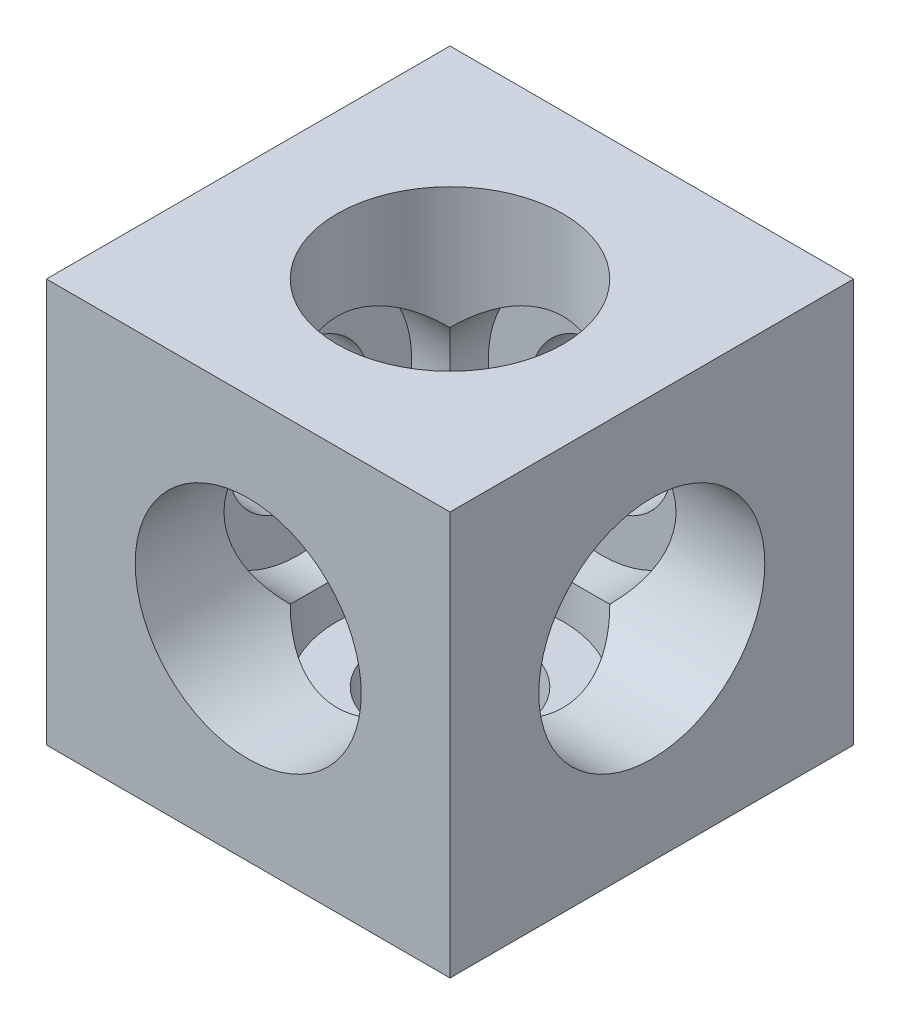
ISO-10303-21;
HEADER;
FILE_DESCRIPTION(('STEP AP214'),'2;1');
FILE_NAME('part.step','',(''),(''),'','','');
FILE_SCHEMA(('AUTOMOTIVE_DESIGN { 1 0 10303 214 1 1 1 1 }'));
ENDSEC;
DATA;
#1=APPLICATION_CONTEXT('core data for automotive mechanical design processes');
#2=APPLICATION_PROTOCOL_DEFINITION('international standard','automotive_design',2000,#1);
#3=PRODUCT_CONTEXT('',#1,'mechanical');
#4=PRODUCT('Part','Part','',(#3));
#5=PRODUCT_RELATED_PRODUCT_CATEGORY('part','',(#4));
#6=PRODUCT_DEFINITION_FORMATION('','',#4);
#7=PRODUCT_DEFINITION_CONTEXT('part definition',#1,'design');
#8=PRODUCT_DEFINITION('design','',#6,#7);
#9=PRODUCT_DEFINITION_SHAPE('','',#8);
#10=(LENGTH_UNIT() NAMED_UNIT(*) SI_UNIT(.MILLI.,.METRE.));
#11=(NAMED_UNIT(*) PLANE_ANGLE_UNIT() SI_UNIT($,.RADIAN.));
#12=(NAMED_UNIT(*) SI_UNIT($,.STERADIAN.) SOLID_ANGLE_UNIT());
#13=UNCERTAINTY_MEASURE_WITH_UNIT(LENGTH_MEASURE(1.E-05),#10,'distance_accuracy_value','');
#14=(GEOMETRIC_REPRESENTATION_CONTEXT(3) GLOBAL_UNCERTAINTY_ASSIGNED_CONTEXT((#13)) GLOBAL_UNIT_ASSIGNED_CONTEXT((#10,
#11,#12)) REPRESENTATION_CONTEXT('',''));
#15=CARTESIAN_POINT('',(0.,0.,0.));
#16=DIRECTION('',(0.,0.,1.));
#17=DIRECTION('',(1.,0.,0.));
#18=AXIS2_PLACEMENT_3D('',#15,#16,#17);
#19=CARTESIAN_POINT('',(-10.,0.,0.));
#20=DIRECTION('',(1.,0.,0.));
#21=DIRECTION('',(0.,0.,-1.));
#22=AXIS2_PLACEMENT_3D('',#19,#20,#21);
#23=CYLINDRICAL_SURFACE('',#22,3.5);
#24=CARTESIAN_POINT('',(-10.,0.,0.));
#25=DIRECTION('',(1.,0.,0.));
#26=DIRECTION('',(0.,0.,-1.));
#27=AXIS2_PLACEMENT_3D('',#24,#25,#26);
#28=CIRCLE('',#27,3.5);
#29=CARTESIAN_POINT('',(-10.,0.,-3.5));
#30=VERTEX_POINT('',#29);
#31=EDGE_CURVE('E147',#30,#30,#28,.T.);
#32=ORIENTED_EDGE('',*,*,#31,.F.);
#33=EDGE_LOOP('',(#32));
#34=FACE_BOUND('',#33,.T.);
#35=CARTESIAN_POINT('',(-7.5,0.,0.));
#36=DIRECTION('',(1.,0.,0.));
#37=DIRECTION('',(0.,0.,-1.));
#38=AXIS2_PLACEMENT_3D('',#35,#36,#37);
#39=CIRCLE('',#38,3.5);
#40=CARTESIAN_POINT('',(-7.5,0.,-3.5));
#41=VERTEX_POINT('',#40);
#42=EDGE_CURVE('E40',#41,#41,#39,.F.);
#43=ORIENTED_EDGE('',*,*,#42,.F.);
#44=EDGE_LOOP('',(#43));
#45=FACE_BOUND('',#44,.T.);
#46=ADVANCED_FACE('F36',(#34,#45),#23,.F.);
#47=CARTESIAN_POINT('',(0.,0.,-10.));
#48=DIRECTION('',(0.,0.,1.));
#49=DIRECTION('',(1.,0.,0.));
#50=AXIS2_PLACEMENT_3D('',#47,#48,#49);
#51=CYLINDRICAL_SURFACE('',#50,3.5);
#52=CARTESIAN_POINT('',(0.,0.,-10.));
#53=DIRECTION('',(0.,0.,1.));
#54=DIRECTION('',(1.,0.,0.));
#55=AXIS2_PLACEMENT_3D('',#52,#53,#54);
#56=CIRCLE('',#55,3.5);
#57=CARTESIAN_POINT('',(3.5,0.,-10.));
#58=VERTEX_POINT('',#57);
#59=EDGE_CURVE('E150',#58,#58,#56,.T.);
#60=ORIENTED_EDGE('',*,*,#59,.F.);
#61=EDGE_LOOP('',(#60));
#62=FACE_BOUND('',#61,.T.);
#63=CARTESIAN_POINT('',(0.,0.,-7.5));
#64=DIRECTION('',(0.,0.,1.));
#65=DIRECTION('',(1.,0.,0.));
#66=AXIS2_PLACEMENT_3D('',#63,#64,#65);
#67=CIRCLE('',#66,3.5);
#68=CARTESIAN_POINT('',(3.5,0.,-7.5));
#69=VERTEX_POINT('',#68);
#70=EDGE_CURVE('E124',#69,#69,#67,.F.);
#71=ORIENTED_EDGE('',*,*,#70,.F.);
#72=EDGE_LOOP('',(#71));
#73=FACE_BOUND('',#72,.T.);
#74=ADVANCED_FACE('F225',(#62,#73),#51,.F.);
#75=CARTESIAN_POINT('',(0.,-7.5,0.));
#76=DIRECTION('',(0.,1.,0.));
#77=DIRECTION('',(-1.,0.,0.));
#78=AXIS2_PLACEMENT_3D('',#75,#76,#77);
#79=CYLINDRICAL_SURFACE('',#78,5.6);
#80=CARTESIAN_POINT('',(0.,10.,0.));
#81=DIRECTION('',(0.,1.,0.));
#82=DIRECTION('',(-1.,0.,0.));
#83=AXIS2_PLACEMENT_3D('',#80,#81,#82);
#84=CIRCLE('',#83,5.6);
#85=CARTESIAN_POINT('',(-5.6,10.,0.));
#86=VERTEX_POINT('',#85);
#87=EDGE_CURVE('E126',#86,#86,#84,.T.);
#88=ORIENTED_EDGE('',*,*,#87,.T.);
#89=EDGE_LOOP('',(#88));
#90=FACE_BOUND('',#89,.T.);
#91=CARTESIAN_POINT('',(0.,0.,0.));
#92=DIRECTION('',(0.,0.707106781186547,-0.707106781186547));
#93=DIRECTION('',(0.,0.707106781186547,0.707106781186547));
#94=AXIS2_PLACEMENT_3D('',#91,#92,#93);
#95=ELLIPSE('',#94,7.91959594928933,5.6);
#96=CARTESIAN_POINT('',(3.95979797464466,3.95979797464467,3.95979797464467));
#97=VERTEX_POINT('',#96);
#98=CARTESIAN_POINT('',(-3.95979797464467,3.95979797464467,3.95979797464467));
#99=VERTEX_POINT('',#98);
#100=EDGE_CURVE('E113',#97,#99,#95,.F.);
#101=ORIENTED_EDGE('',*,*,#100,.T.);
#102=CARTESIAN_POINT('',(0.,0.,0.));
#103=DIRECTION('',(0.707106781186547,0.707106781186548,0.));
#104=DIRECTION('',(-0.707106781186547,0.707106781186547,0.));
#105=AXIS2_PLACEMENT_3D('',#102,#103,#104);
#106=ELLIPSE('',#105,7.91959594928933,5.6);
#107=CARTESIAN_POINT('',(-3.95979797464466,3.95979797464466,-3.95979797464467));
#108=VERTEX_POINT('',#107);
#109=EDGE_CURVE('E100',#99,#108,#106,.F.);
#110=ORIENTED_EDGE('',*,*,#109,.T.);
#111=CARTESIAN_POINT('',(0.,0.,0.));
#112=DIRECTION('',(0.,0.707106781186547,0.707106781186547));
#113=DIRECTION('',(0.,0.707106781186547,-0.707106781186547));
#114=AXIS2_PLACEMENT_3D('',#111,#112,#113);
#115=ELLIPSE('',#114,7.91959594928933,5.6);
#116=CARTESIAN_POINT('',(3.95979797464466,3.95979797464466,-3.95979797464467));
#117=VERTEX_POINT('',#116);
#118=EDGE_CURVE('E106',#108,#117,#115,.F.);
#119=ORIENTED_EDGE('',*,*,#118,.T.);
#120=CARTESIAN_POINT('',(0.,0.,0.));
#121=DIRECTION('',(-0.707106781186547,0.707106781186547,0.));
#122=DIRECTION('',(0.707106781186547,0.707106781186548,0.));
#123=AXIS2_PLACEMENT_3D('',#120,#121,#122);
#124=ELLIPSE('',#123,7.91959594928933,5.6);
#125=EDGE_CURVE('E52',#117,#97,#124,.F.);
#126=ORIENTED_EDGE('',*,*,#125,.T.);
#127=EDGE_LOOP('',(#101,#110,#119,#126));
#128=FACE_BOUND('',#127,.T.);
#129=ADVANCED_FACE('F111',(#90,#128),#79,.F.);
#130=CARTESIAN_POINT('',(0.,-10.,0.));
#131=DIRECTION('',(0.,1.,0.));
#132=DIRECTION('',(-1.,0.,0.));
#133=AXIS2_PLACEMENT_3D('',#130,#131,#132);
#134=CYLINDRICAL_SURFACE('',#133,3.5);
#135=CARTESIAN_POINT('',(0.,-10.,0.));
#136=DIRECTION('',(0.,1.,0.));
#137=DIRECTION('',(-1.,0.,0.));
#138=AXIS2_PLACEMENT_3D('',#135,#136,#137);
#139=CIRCLE('',#138,3.5);
#140=CARTESIAN_POINT('',(-3.5,-10.,0.));
#141=VERTEX_POINT('',#140);
#142=EDGE_CURVE('E153',#141,#141,#139,.T.);
#143=ORIENTED_EDGE('',*,*,#142,.F.);
#144=EDGE_LOOP('',(#143));
#145=FACE_BOUND('',#144,.T.);
#146=CARTESIAN_POINT('',(0.,-7.5,0.));
#147=DIRECTION('',(0.,1.,0.));
#148=DIRECTION('',(-1.,0.,0.));
#149=AXIS2_PLACEMENT_3D('',#146,#147,#148);
#150=CIRCLE('',#149,3.5);
#151=CARTESIAN_POINT('',(-3.5,-7.5,0.));
#152=VERTEX_POINT('',#151);
#153=EDGE_CURVE('E145',#152,#152,#150,.F.);
#154=ORIENTED_EDGE('',*,*,#153,.F.);
#155=EDGE_LOOP('',(#154));
#156=FACE_BOUND('',#155,.T.);
#157=ADVANCED_FACE('F238',(#145,#156),#134,.F.);
#158=CARTESIAN_POINT('',(-10.,-10.,10.));
#159=DIRECTION('',(1.,0.,0.));
#160=DIRECTION('',(0.,0.,-1.));
#161=AXIS2_PLACEMENT_3D('',#158,#159,#160);
#162=PLANE('',#161);
#163=ORIENTED_EDGE('',*,*,#31,.T.);
#164=EDGE_LOOP('',(#163));
#165=FACE_BOUND('',#164,.T.);
#166=DIRECTION('',(0.,-1.,0.));
#167=VECTOR('',#166,1.);
#168=CARTESIAN_POINT('',(-10.,-10.,-10.));
#169=LINE('',#168,#167);
#170=CARTESIAN_POINT('',(-10.,10.,-10.));
#171=VERTEX_POINT('',#170);
#172=CARTESIAN_POINT('',(-10.,-10.,-10.));
#173=VERTEX_POINT('',#172);
#174=EDGE_CURVE('E156',#171,#173,#169,.T.);
#175=ORIENTED_EDGE('',*,*,#174,.T.);
#176=DIRECTION('',(0.,0.,-1.));
#177=VECTOR('',#176,1.);
#178=CARTESIAN_POINT('',(-10.,-10.,10.));
#179=LINE('',#178,#177);
#180=CARTESIAN_POINT('',(-10.,-10.,10.));
#181=VERTEX_POINT('',#180);
#182=EDGE_CURVE('E183',#181,#173,#179,.T.);
#183=ORIENTED_EDGE('',*,*,#182,.F.);
#184=DIRECTION('',(0.,-1.,0.));
#185=VECTOR('',#184,1.);
#186=CARTESIAN_POINT('',(-10.,-10.,10.));
#187=LINE('',#186,#185);
#188=CARTESIAN_POINT('',(-10.,10.,10.));
#189=VERTEX_POINT('',#188);
#190=EDGE_CURVE('E157',#189,#181,#187,.T.);
#191=ORIENTED_EDGE('',*,*,#190,.F.);
#192=DIRECTION('',(0.,0.,-1.));
#193=VECTOR('',#192,1.);
#194=CARTESIAN_POINT('',(-10.,10.,10.));
#195=LINE('',#194,#193);
#196=EDGE_CURVE('E167',#189,#171,#195,.T.);
#197=ORIENTED_EDGE('',*,*,#196,.T.);
#198=EDGE_LOOP('',(#175,#183,#191,#197));
#199=FACE_BOUND('',#198,.T.);
#200=ADVANCED_FACE('F38',(#165,#199),#162,.F.);
#201=CARTESIAN_POINT('',(10.,-9.99999999999999,10.));
#202=DIRECTION('',(0.,1.,0.));
#203=DIRECTION('',(-1.,0.,0.));
#204=AXIS2_PLACEMENT_3D('',#201,#202,#203);
#205=PLANE('',#204);
#206=ORIENTED_EDGE('',*,*,#142,.T.);
#207=EDGE_LOOP('',(#206));
#208=FACE_BOUND('',#207,.T.);
#209=DIRECTION('',(1.,0.,0.));
#210=VECTOR('',#209,1.);
#211=CARTESIAN_POINT('',(10.,-9.99999999999999,-10.));
#212=LINE('',#211,#210);
#213=CARTESIAN_POINT('',(10.,-9.99999999999999,-10.));
#214=VERTEX_POINT('',#213);
#215=EDGE_CURVE('E170',#173,#214,#212,.T.);
#216=ORIENTED_EDGE('',*,*,#215,.T.);
#217=DIRECTION('',(0.,0.,-1.));
#218=VECTOR('',#217,1.);
#219=CARTESIAN_POINT('',(10.,-9.99999999999999,10.));
#220=LINE('',#219,#218);
#221=CARTESIAN_POINT('',(10.,-9.99999999999999,10.));
#222=VERTEX_POINT('',#221);
#223=EDGE_CURVE('E180',#222,#214,#220,.T.);
#224=ORIENTED_EDGE('',*,*,#223,.F.);
#225=DIRECTION('',(1.,0.,0.));
#226=VECTOR('',#225,1.);
#227=CARTESIAN_POINT('',(10.,-9.99999999999999,10.));
#228=LINE('',#227,#226);
#229=EDGE_CURVE('E160',#181,#222,#228,.T.);
#230=ORIENTED_EDGE('',*,*,#229,.F.);
#231=ORIENTED_EDGE('',*,*,#182,.T.);
#232=EDGE_LOOP('',(#216,#224,#230,#231));
#233=FACE_BOUND('',#232,.T.);
#234=ADVANCED_FACE('F257',(#208,#233),#205,.F.);
#235=CARTESIAN_POINT('',(10.,-9.99999999999999,10.));
#236=DIRECTION('',(-1.,0.,0.));
#237=DIRECTION('',(0.,0.,1.));
#238=AXIS2_PLACEMENT_3D('',#235,#236,#237);
#239=PLANE('',#238);
#240=CARTESIAN_POINT('',(10.,0.,0.));
#241=DIRECTION('',(1.,0.,0.));
#242=DIRECTION('',(0.,0.,-1.));
#243=AXIS2_PLACEMENT_3D('',#240,#241,#242);
#244=CIRCLE('',#243,5.6);
#245=CARTESIAN_POINT('',(10.,0.,-5.6));
#246=VERTEX_POINT('',#245);
#247=EDGE_CURVE('E200',#246,#246,#244,.T.);
#248=ORIENTED_EDGE('',*,*,#247,.F.);
#249=EDGE_LOOP('',(#248));
#250=FACE_BOUND('',#249,.T.);
#251=DIRECTION('',(0.,1.,0.));
#252=VECTOR('',#251,1.);
#253=CARTESIAN_POINT('',(10.,-9.99999999999999,-10.));
#254=LINE('',#253,#252);
#255=CARTESIAN_POINT('',(10.,10.,-10.));
#256=VERTEX_POINT('',#255);
#257=EDGE_CURVE('E172',#214,#256,#254,.T.);
#258=ORIENTED_EDGE('',*,*,#257,.T.);
#259=DIRECTION('',(0.,0.,-1.));
#260=VECTOR('',#259,1.);
#261=CARTESIAN_POINT('',(10.,10.,10.));
#262=LINE('',#261,#260);
#263=CARTESIAN_POINT('',(10.,10.,10.));
#264=VERTEX_POINT('',#263);
#265=EDGE_CURVE('E177',#264,#256,#262,.T.);
#266=ORIENTED_EDGE('',*,*,#265,.F.);
#267=DIRECTION('',(0.,1.,0.));
#268=VECTOR('',#267,1.);
#269=CARTESIAN_POINT('',(10.,-9.99999999999999,10.));
#270=LINE('',#269,#268);
#271=EDGE_CURVE('E163',#222,#264,#270,.T.);
#272=ORIENTED_EDGE('',*,*,#271,.F.);
#273=ORIENTED_EDGE('',*,*,#223,.T.);
#274=EDGE_LOOP('',(#258,#266,#272,#273));
#275=FACE_BOUND('',#274,.T.);
#276=ADVANCED_FACE('F254',(#250,#275),#239,.F.);
#277=CARTESIAN_POINT('',(10.,10.,10.));
#278=DIRECTION('',(0.,-1.,0.));
#279=DIRECTION('',(1.,0.,0.));
#280=AXIS2_PLACEMENT_3D('',#277,#278,#279);
#281=PLANE('',#280);
#282=ORIENTED_EDGE('',*,*,#87,.F.);
#283=EDGE_LOOP('',(#282));
#284=FACE_BOUND('',#283,.T.);
#285=DIRECTION('',(-1.,0.,0.));
#286=VECTOR('',#285,1.);
#287=CARTESIAN_POINT('',(10.,10.,-10.));
#288=LINE('',#287,#286);
#289=EDGE_CURVE('E161',#256,#171,#288,.T.);
#290=ORIENTED_EDGE('',*,*,#289,.T.);
#291=ORIENTED_EDGE('',*,*,#196,.F.);
#292=DIRECTION('',(-1.,0.,0.));
#293=VECTOR('',#292,1.);
#294=CARTESIAN_POINT('',(10.,10.,10.));
#295=LINE('',#294,#293);
#296=EDGE_CURVE('E165',#264,#189,#295,.T.);
#297=ORIENTED_EDGE('',*,*,#296,.F.);
#298=ORIENTED_EDGE('',*,*,#265,.T.);
#299=EDGE_LOOP('',(#290,#291,#297,#298));
#300=FACE_BOUND('',#299,.T.);
#301=ADVANCED_FACE('F246',(#284,#300),#281,.F.);
#302=CARTESIAN_POINT('',(0.,0.,10.));
#303=DIRECTION('',(0.,0.,1.));
#304=DIRECTION('',(1.,0.,0.));
#305=AXIS2_PLACEMENT_3D('',#302,#303,#304);
#306=PLANE('',#305);
#307=CARTESIAN_POINT('',(0.,0.,10.));
#308=DIRECTION('',(0.,0.,1.));
#309=DIRECTION('',(1.,0.,0.));
#310=AXIS2_PLACEMENT_3D('',#307,#308,#309);
#311=CIRCLE('',#310,5.6);
#312=CARTESIAN_POINT('',(5.6,0.,10.));
#313=VERTEX_POINT('',#312);
#314=EDGE_CURVE('E134',#313,#313,#311,.T.);
#315=ORIENTED_EDGE('',*,*,#314,.F.);
#316=EDGE_LOOP('',(#315));
#317=FACE_BOUND('',#316,.T.);
#318=ORIENTED_EDGE('',*,*,#190,.T.);
#319=ORIENTED_EDGE('',*,*,#229,.T.);
#320=ORIENTED_EDGE('',*,*,#271,.T.);
#321=ORIENTED_EDGE('',*,*,#296,.T.);
#322=EDGE_LOOP('',(#318,#319,#320,#321));
#323=FACE_BOUND('',#322,.T.);
#324=ADVANCED_FACE('F242',(#317,#323),#306,.T.);
#325=CARTESIAN_POINT('',(0.,0.,-10.));
#326=DIRECTION('',(0.,0.,1.));
#327=DIRECTION('',(1.,0.,0.));
#328=AXIS2_PLACEMENT_3D('',#325,#326,#327);
#329=PLANE('',#328);
#330=ORIENTED_EDGE('',*,*,#59,.T.);
#331=EDGE_LOOP('',(#330));
#332=FACE_BOUND('',#331,.T.);
#333=ORIENTED_EDGE('',*,*,#174,.F.);
#334=ORIENTED_EDGE('',*,*,#289,.F.);
#335=ORIENTED_EDGE('',*,*,#257,.F.);
#336=ORIENTED_EDGE('',*,*,#215,.F.);
#337=EDGE_LOOP('',(#333,#334,#335,#336));
#338=FACE_BOUND('',#337,.T.);
#339=ADVANCED_FACE('F245',(#332,#338),#329,.F.);
#340=CARTESIAN_POINT('',(0.,-7.5,0.));
#341=DIRECTION('',(0.,1.,0.));
#342=DIRECTION('',(-1.,0.,0.));
#343=AXIS2_PLACEMENT_3D('',#340,#341,#342);
#344=PLANE('',#343);
#345=CARTESIAN_POINT('',(0.,-7.5,0.));
#346=DIRECTION('',(0.,1.,0.));
#347=DIRECTION('',(-1.,0.,0.));
#348=AXIS2_PLACEMENT_3D('',#345,#346,#347);
#349=CIRCLE('',#348,5.6);
#350=CARTESIAN_POINT('',(-5.6,-7.5,0.));
#351=VERTEX_POINT('',#350);
#352=EDGE_CURVE('E131',#351,#351,#349,.T.);
#353=ORIENTED_EDGE('',*,*,#352,.T.);
#354=EDGE_LOOP('',(#353));
#355=FACE_BOUND('',#354,.T.);
#356=ORIENTED_EDGE('',*,*,#153,.T.);
#357=EDGE_LOOP('',(#356));
#358=FACE_BOUND('',#357,.T.);
#359=ADVANCED_FACE('F250',(#355,#358),#344,.T.);
#360=CARTESIAN_POINT('',(0.,0.,0.));
#361=DIRECTION('',(0.,0.707106781186547,0.707106781186547));
#362=DIRECTION('',(0.,0.707106781186547,-0.707106781186547));
#363=AXIS2_PLACEMENT_3D('',#360,#361,#362);
#364=ELLIPSE('',#363,7.91959594928933,5.6);
#365=CARTESIAN_POINT('',(-3.95979797464466,-3.95979797464467,3.95979797464467));
#366=VERTEX_POINT('',#365);
#367=CARTESIAN_POINT('',(3.95979797464467,-3.95979797464467,3.95979797464467));
#368=VERTEX_POINT('',#367);
#369=EDGE_CURVE('E117',#366,#368,#364,.T.);
#370=ORIENTED_EDGE('',*,*,#369,.T.);
#371=CARTESIAN_POINT('',(0.,0.,0.));
#372=DIRECTION('',(0.707106781186547,0.707106781186548,0.));
#373=DIRECTION('',(-0.707106781186547,0.707106781186547,0.));
#374=AXIS2_PLACEMENT_3D('',#371,#372,#373);
#375=ELLIPSE('',#374,7.91959594928933,5.6);
#376=CARTESIAN_POINT('',(3.95979797464466,-3.95979797464466,-3.95979797464467));
#377=VERTEX_POINT('',#376);
#378=EDGE_CURVE('E193',#368,#377,#375,.T.);
#379=ORIENTED_EDGE('',*,*,#378,.T.);
#380=CARTESIAN_POINT('',(0.,0.,0.));
#381=DIRECTION('',(0.,0.707106781186547,-0.707106781186547));
#382=DIRECTION('',(0.,0.707106781186547,0.707106781186547));
#383=AXIS2_PLACEMENT_3D('',#380,#381,#382);
#384=ELLIPSE('',#383,7.91959594928933,5.6);
#385=CARTESIAN_POINT('',(-3.95979797464466,-3.95979797464466,-3.95979797464467));
#386=VERTEX_POINT('',#385);
#387=EDGE_CURVE('E120',#377,#386,#384,.T.);
#388=ORIENTED_EDGE('',*,*,#387,.T.);
#389=CARTESIAN_POINT('',(0.,0.,0.));
#390=DIRECTION('',(-0.707106781186547,0.707106781186547,0.));
#391=DIRECTION('',(0.707106781186547,0.707106781186548,0.));
#392=AXIS2_PLACEMENT_3D('',#389,#390,#391);
#393=ELLIPSE('',#392,7.91959594928933,5.6);
#394=EDGE_CURVE('E59',#386,#366,#393,.T.);
#395=ORIENTED_EDGE('',*,*,#394,.T.);
#396=EDGE_LOOP('',(#370,#379,#388,#395));
#397=FACE_BOUND('',#396,.T.);
#398=ORIENTED_EDGE('',*,*,#352,.F.);
#399=EDGE_LOOP('',(#398));
#400=FACE_BOUND('',#399,.T.);
#401=ADVANCED_FACE('F190',(#397,#400),#79,.F.);
#402=CARTESIAN_POINT('',(0.,0.,-7.5));
#403=DIRECTION('',(0.,0.,1.));
#404=DIRECTION('',(1.,0.,0.));
#405=AXIS2_PLACEMENT_3D('',#402,#403,#404);
#406=CYLINDRICAL_SURFACE('',#405,5.6);
#407=ORIENTED_EDGE('',*,*,#314,.T.);
#408=EDGE_LOOP('',(#407));
#409=FACE_BOUND('',#408,.T.);
#410=ORIENTED_EDGE('',*,*,#369,.F.);
#411=CARTESIAN_POINT('',(0.,0.,0.));
#412=DIRECTION('',(0.707106781186547,0.,0.707106781186547));
#413=DIRECTION('',(-0.707106781186547,0.,0.707106781186547));
#414=AXIS2_PLACEMENT_3D('',#411,#412,#413);
#415=ELLIPSE('',#414,7.91959594928933,5.6);
#416=EDGE_CURVE('E114',#366,#99,#415,.F.);
#417=ORIENTED_EDGE('',*,*,#416,.T.);
#418=ORIENTED_EDGE('',*,*,#100,.F.);
#419=CARTESIAN_POINT('',(0.,0.,0.));
#420=DIRECTION('',(-0.707106781186547,0.,0.707106781186547));
#421=DIRECTION('',(0.707106781186547,0.,0.707106781186547));
#422=AXIS2_PLACEMENT_3D('',#419,#420,#421);
#423=ELLIPSE('',#422,7.91959594928933,5.6);
#424=EDGE_CURVE('E141',#97,#368,#423,.F.);
#425=ORIENTED_EDGE('',*,*,#424,.T.);
#426=EDGE_LOOP('',(#410,#417,#418,#425));
#427=FACE_BOUND('',#426,.T.);
#428=ADVANCED_FACE('F220',(#409,#427),#406,.F.);
#429=CARTESIAN_POINT('',(0.,0.,-7.5));
#430=DIRECTION('',(0.,0.,1.));
#431=DIRECTION('',(1.,0.,0.));
#432=AXIS2_PLACEMENT_3D('',#429,#430,#431);
#433=PLANE('',#432);
#434=CARTESIAN_POINT('',(0.,0.,-7.5));
#435=DIRECTION('',(0.,0.,1.));
#436=DIRECTION('',(1.,0.,0.));
#437=AXIS2_PLACEMENT_3D('',#434,#435,#436);
#438=CIRCLE('',#437,5.6);
#439=CARTESIAN_POINT('',(5.6,0.,-7.5));
#440=VERTEX_POINT('',#439);
#441=EDGE_CURVE('E127',#440,#440,#438,.T.);
#442=ORIENTED_EDGE('',*,*,#441,.T.);
#443=EDGE_LOOP('',(#442));
#444=FACE_BOUND('',#443,.T.);
#445=ORIENTED_EDGE('',*,*,#70,.T.);
#446=EDGE_LOOP('',(#445));
#447=FACE_BOUND('',#446,.T.);
#448=ADVANCED_FACE('F217',(#444,#447),#433,.T.);
#449=ORIENTED_EDGE('',*,*,#441,.F.);
#450=EDGE_LOOP('',(#449));
#451=FACE_BOUND('',#450,.T.);
#452=ORIENTED_EDGE('',*,*,#387,.F.);
#453=CARTESIAN_POINT('',(0.,0.,0.));
#454=DIRECTION('',(0.707106781186547,0.,0.707106781186547));
#455=DIRECTION('',(-0.707106781186547,0.,0.707106781186547));
#456=AXIS2_PLACEMENT_3D('',#453,#454,#455);
#457=ELLIPSE('',#456,7.91959594928933,5.6);
#458=EDGE_CURVE('E11',#377,#117,#457,.T.);
#459=ORIENTED_EDGE('',*,*,#458,.T.);
#460=ORIENTED_EDGE('',*,*,#118,.F.);
#461=CARTESIAN_POINT('',(0.,0.,0.));
#462=DIRECTION('',(-0.707106781186547,0.,0.707106781186547));
#463=DIRECTION('',(0.707106781186547,0.,0.707106781186547));
#464=AXIS2_PLACEMENT_3D('',#461,#462,#463);
#465=ELLIPSE('',#464,7.91959594928933,5.6);
#466=EDGE_CURVE('E45',#108,#386,#465,.T.);
#467=ORIENTED_EDGE('',*,*,#466,.T.);
#468=EDGE_LOOP('',(#452,#459,#460,#467));
#469=FACE_BOUND('',#468,.T.);
#470=ADVANCED_FACE('F116',(#451,#469),#406,.F.);
#471=CARTESIAN_POINT('',(-7.5,0.,0.));
#472=DIRECTION('',(1.,0.,0.));
#473=DIRECTION('',(0.,0.,-1.));
#474=AXIS2_PLACEMENT_3D('',#471,#472,#473);
#475=CYLINDRICAL_SURFACE('',#474,5.6);
#476=CARTESIAN_POINT('',(-7.5,0.,0.));
#477=DIRECTION('',(1.,0.,0.));
#478=DIRECTION('',(0.,0.,-1.));
#479=AXIS2_PLACEMENT_3D('',#476,#477,#478);
#480=CIRCLE('',#479,5.6);
#481=CARTESIAN_POINT('',(-7.5,0.,-5.6));
#482=VERTEX_POINT('',#481);
#483=EDGE_CURVE('E199',#482,#482,#480,.T.);
#484=ORIENTED_EDGE('',*,*,#483,.F.);
#485=EDGE_LOOP('',(#484));
#486=FACE_BOUND('',#485,.T.);
#487=ORIENTED_EDGE('',*,*,#394,.F.);
#488=ORIENTED_EDGE('',*,*,#466,.F.);
#489=ORIENTED_EDGE('',*,*,#109,.F.);
#490=ORIENTED_EDGE('',*,*,#416,.F.);
#491=EDGE_LOOP('',(#487,#488,#489,#490));
#492=FACE_BOUND('',#491,.T.);
#493=ADVANCED_FACE('F99',(#486,#492),#475,.F.);
#494=CARTESIAN_POINT('',(-7.5,0.,0.));
#495=DIRECTION('',(1.,0.,0.));
#496=DIRECTION('',(0.,0.,-1.));
#497=AXIS2_PLACEMENT_3D('',#494,#495,#496);
#498=PLANE('',#497);
#499=ORIENTED_EDGE('',*,*,#483,.T.);
#500=EDGE_LOOP('',(#499));
#501=FACE_BOUND('',#500,.T.);
#502=ORIENTED_EDGE('',*,*,#42,.T.);
#503=EDGE_LOOP('',(#502));
#504=FACE_BOUND('',#503,.T.);
#505=ADVANCED_FACE('F206',(#501,#504),#498,.T.);
#506=ORIENTED_EDGE('',*,*,#247,.T.);
#507=EDGE_LOOP('',(#506));
#508=FACE_BOUND('',#507,.T.);
#509=ORIENTED_EDGE('',*,*,#125,.F.);
#510=ORIENTED_EDGE('',*,*,#458,.F.);
#511=ORIENTED_EDGE('',*,*,#378,.F.);
#512=ORIENTED_EDGE('',*,*,#424,.F.);
#513=EDGE_LOOP('',(#509,#510,#511,#512));
#514=FACE_BOUND('',#513,.T.);
#515=ADVANCED_FACE('F211',(#508,#514),#475,.F.);
#516=CLOSED_SHELL('',(#46,#74,#129,#157,#200,#234,#276,#301,#324,#339,#359,#401,#428,#448,#470,
#493,#505,#515));
#517=MANIFOLD_SOLID_BREP('B2',#516);
#518=ADVANCED_BREP_SHAPE_REPRESENTATION('',(#18,#517),#14);
#519=SHAPE_DEFINITION_REPRESENTATION(#9,#518);
ENDSEC;
END-ISO-10303-21;
